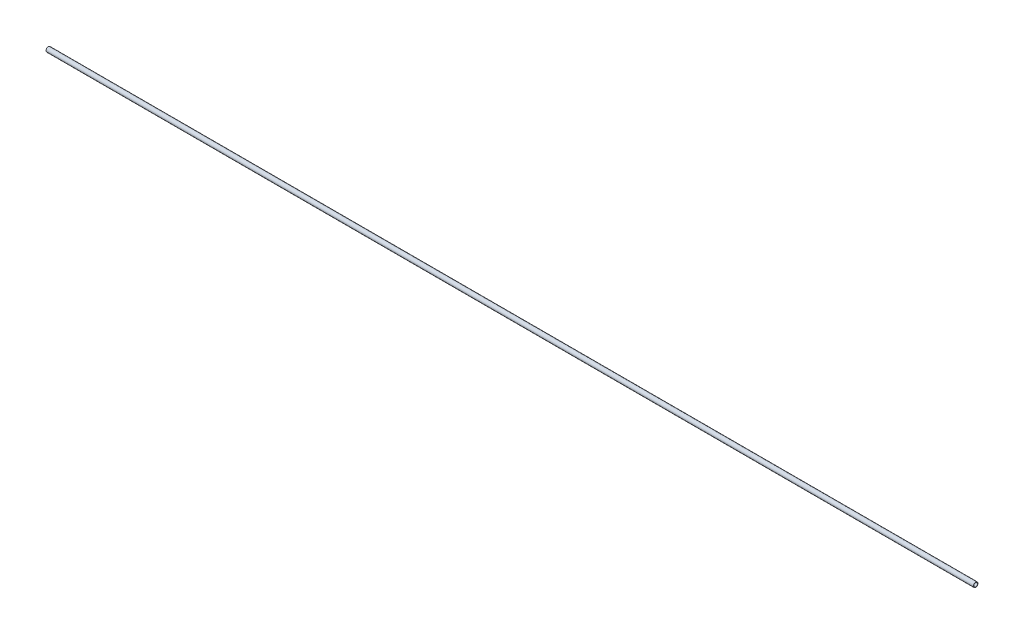
ISO-10303-21;
HEADER;
FILE_DESCRIPTION(('STEP AP214'),'2;1');
FILE_NAME('part.step','',(''),(''),'','','');
FILE_SCHEMA(('AUTOMOTIVE_DESIGN { 1 0 10303 214 1 1 1 1 }'));
ENDSEC;
DATA;
#1=APPLICATION_CONTEXT('core data for automotive mechanical design processes');
#2=APPLICATION_PROTOCOL_DEFINITION('international standard','automotive_design',2000,#1);
#3=PRODUCT_CONTEXT('',#1,'mechanical');
#4=PRODUCT('Part','Part','',(#3));
#5=PRODUCT_RELATED_PRODUCT_CATEGORY('part','',(#4));
#6=PRODUCT_DEFINITION_FORMATION('','',#4);
#7=PRODUCT_DEFINITION_CONTEXT('part definition',#1,'design');
#8=PRODUCT_DEFINITION('design','',#6,#7);
#9=PRODUCT_DEFINITION_SHAPE('','',#8);
#10=(LENGTH_UNIT() NAMED_UNIT(*) SI_UNIT(.MILLI.,.METRE.));
#11=(NAMED_UNIT(*) PLANE_ANGLE_UNIT() SI_UNIT($,.RADIAN.));
#12=(NAMED_UNIT(*) SI_UNIT($,.STERADIAN.) SOLID_ANGLE_UNIT());
#13=UNCERTAINTY_MEASURE_WITH_UNIT(LENGTH_MEASURE(1.E-05),#10,'distance_accuracy_value','');
#14=(GEOMETRIC_REPRESENTATION_CONTEXT(3) GLOBAL_UNCERTAINTY_ASSIGNED_CONTEXT((#13)) GLOBAL_UNIT_ASSIGNED_CONTEXT((#10,
#11,#12)) REPRESENTATION_CONTEXT('',''));
#15=CARTESIAN_POINT('',(0.,0.,0.));
#16=DIRECTION('',(0.,0.,1.));
#17=DIRECTION('',(1.,0.,0.));
#18=AXIS2_PLACEMENT_3D('',#15,#16,#17);
#19=CARTESIAN_POINT('',(0.,0.,0.));
#20=DIRECTION('',(1.,0.,0.));
#21=DIRECTION('',(0.,0.,-1.));
#22=AXIS2_PLACEMENT_3D('',#19,#20,#21);
#23=CYLINDRICAL_SURFACE('',#22,10.2);
#24=CARTESIAN_POINT('',(0.,0.,0.));
#25=DIRECTION('',(1.,0.,0.));
#26=DIRECTION('',(0.,0.,-1.));
#27=AXIS2_PLACEMENT_3D('',#24,#25,#26);
#28=CIRCLE('',#27,10.2);
#29=CARTESIAN_POINT('',(0.,0.,-10.2));
#30=VERTEX_POINT('',#29);
#31=EDGE_CURVE('E16',#30,#30,#28,.T.);
#32=ORIENTED_EDGE('',*,*,#31,.F.);
#33=EDGE_LOOP('',(#32));
#34=FACE_BOUND('',#33,.T.);
#35=CARTESIAN_POINT('',(5000.,0.,0.));
#36=DIRECTION('',(1.,0.,0.));
#37=DIRECTION('',(0.,0.,-1.));
#38=AXIS2_PLACEMENT_3D('',#35,#36,#37);
#39=CIRCLE('',#38,10.2);
#40=CARTESIAN_POINT('',(5000.,0.,-10.2));
#41=VERTEX_POINT('',#40);
#42=EDGE_CURVE('E25',#41,#41,#39,.F.);
#43=ORIENTED_EDGE('',*,*,#42,.F.);
#44=EDGE_LOOP('',(#43));
#45=FACE_BOUND('',#44,.T.);
#46=ADVANCED_FACE('F13',(#34,#45),#23,.F.);
#47=CARTESIAN_POINT('',(0.,-12.6500021083317,-12.5));
#48=DIRECTION('',(-1.,0.,0.));
#49=DIRECTION('',(0.,0.,1.));
#50=AXIS2_PLACEMENT_3D('',#47,#48,#49);
#51=PLANE('',#50);
#52=ORIENTED_EDGE('',*,*,#31,.T.);
#53=EDGE_LOOP('',(#52));
#54=FACE_BOUND('',#53,.T.);
#55=CARTESIAN_POINT('',(0.,0.,0.));
#56=DIRECTION('',(1.,0.,0.));
#57=DIRECTION('',(0.,0.,-1.));
#58=AXIS2_PLACEMENT_3D('',#55,#56,#57);
#59=CIRCLE('',#58,12.5);
#60=CARTESIAN_POINT('',(0.,0.,-12.5));
#61=VERTEX_POINT('',#60);
#62=EDGE_CURVE('E20',#61,#61,#59,.T.);
#63=ORIENTED_EDGE('',*,*,#62,.F.);
#64=EDGE_LOOP('',(#63));
#65=FACE_BOUND('',#64,.T.);
#66=ADVANCED_FACE('F33',(#54,#65),#51,.T.);
#67=CARTESIAN_POINT('',(5000.,-12.6500021083317,12.5));
#68=DIRECTION('',(1.,0.,0.));
#69=DIRECTION('',(0.,0.,-1.));
#70=AXIS2_PLACEMENT_3D('',#67,#68,#69);
#71=PLANE('',#70);
#72=ORIENTED_EDGE('',*,*,#42,.T.);
#73=EDGE_LOOP('',(#72));
#74=FACE_BOUND('',#73,.T.);
#75=CARTESIAN_POINT('',(5000.,0.,0.));
#76=DIRECTION('',(1.,0.,0.));
#77=DIRECTION('',(0.,0.,-1.));
#78=AXIS2_PLACEMENT_3D('',#75,#76,#77);
#79=CIRCLE('',#78,12.5);
#80=CARTESIAN_POINT('',(5000.,0.,-12.5));
#81=VERTEX_POINT('',#80);
#82=EDGE_CURVE('E8',#81,#81,#79,.F.);
#83=ORIENTED_EDGE('',*,*,#82,.F.);
#84=EDGE_LOOP('',(#83));
#85=FACE_BOUND('',#84,.T.);
#86=ADVANCED_FACE('F42',(#74,#85),#71,.T.);
#87=CARTESIAN_POINT('',(5000.,0.,0.));
#88=DIRECTION('',(1.,0.,0.));
#89=DIRECTION('',(0.,0.,-1.));
#90=AXIS2_PLACEMENT_3D('',#87,#88,#89);
#91=CYLINDRICAL_SURFACE('',#90,12.5);
#92=ORIENTED_EDGE('',*,*,#62,.T.);
#93=EDGE_LOOP('',(#92));
#94=FACE_BOUND('',#93,.T.);
#95=ORIENTED_EDGE('',*,*,#82,.T.);
#96=EDGE_LOOP('',(#95));
#97=FACE_BOUND('',#96,.T.);
#98=ADVANCED_FACE('F43',(#94,#97),#91,.T.);
#99=CLOSED_SHELL('',(#46,#66,#86,#98));
#100=MANIFOLD_SOLID_BREP('B1',#99);
#101=ADVANCED_BREP_SHAPE_REPRESENTATION('',(#18,#100),#14);
#102=SHAPE_DEFINITION_REPRESENTATION(#9,#101);
ENDSEC;
END-ISO-10303-21;
